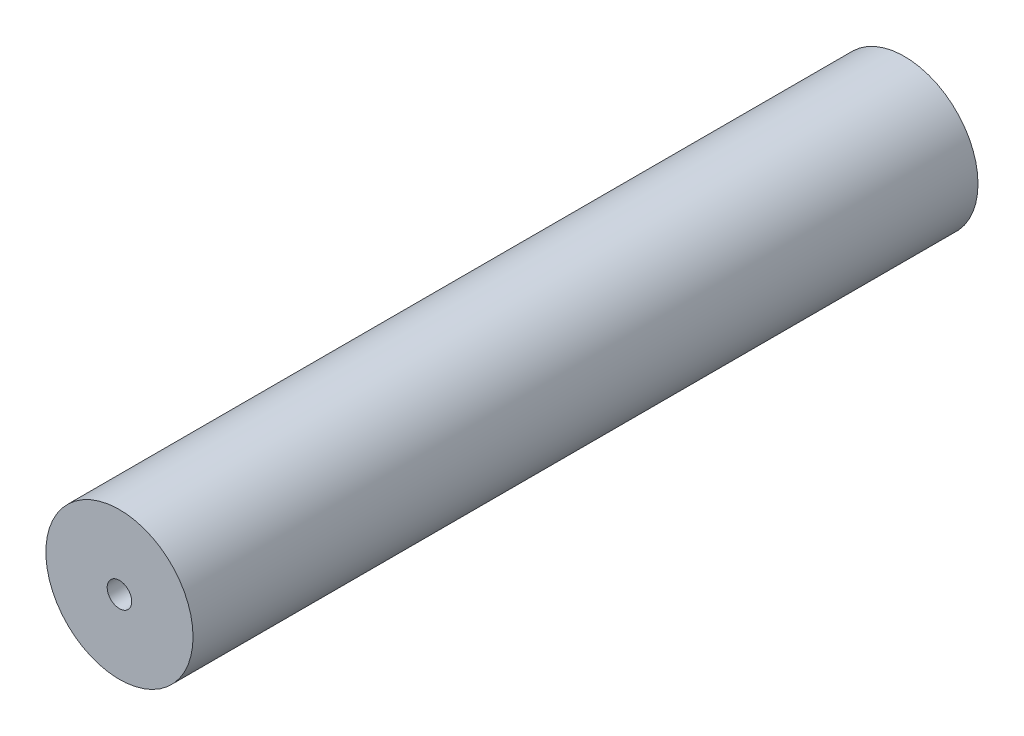
ISO-10303-21;
HEADER;
FILE_DESCRIPTION(('STEP AP214'),'2;1');
FILE_NAME('part.step','',(''),(''),'','','');
FILE_SCHEMA(('AUTOMOTIVE_DESIGN { 1 0 10303 214 1 1 1 1 }'));
ENDSEC;
DATA;
#1=APPLICATION_CONTEXT('core data for automotive mechanical design processes');
#2=APPLICATION_PROTOCOL_DEFINITION('international standard','automotive_design',2000,#1);
#3=PRODUCT_CONTEXT('',#1,'mechanical');
#4=PRODUCT('Part','Part','',(#3));
#5=PRODUCT_RELATED_PRODUCT_CATEGORY('part','',(#4));
#6=PRODUCT_DEFINITION_FORMATION('','',#4);
#7=PRODUCT_DEFINITION_CONTEXT('part definition',#1,'design');
#8=PRODUCT_DEFINITION('design','',#6,#7);
#9=PRODUCT_DEFINITION_SHAPE('','',#8);
#10=(LENGTH_UNIT() NAMED_UNIT(*) SI_UNIT(.MILLI.,.METRE.));
#11=(NAMED_UNIT(*) PLANE_ANGLE_UNIT() SI_UNIT($,.RADIAN.));
#12=(NAMED_UNIT(*) SI_UNIT($,.STERADIAN.) SOLID_ANGLE_UNIT());
#13=UNCERTAINTY_MEASURE_WITH_UNIT(LENGTH_MEASURE(1.E-05),#10,'distance_accuracy_value','');
#14=(GEOMETRIC_REPRESENTATION_CONTEXT(3) GLOBAL_UNCERTAINTY_ASSIGNED_CONTEXT((#13)) GLOBAL_UNIT_ASSIGNED_CONTEXT((#10,
#11,#12)) REPRESENTATION_CONTEXT('',''));
#15=CARTESIAN_POINT('',(0.,0.,0.));
#16=DIRECTION('',(0.,0.,1.));
#17=DIRECTION('',(1.,0.,0.));
#18=AXIS2_PLACEMENT_3D('',#15,#16,#17);
#19=CARTESIAN_POINT('',(0.,0.,80.));
#20=DIRECTION('',(0.,0.,-1.));
#21=DIRECTION('',(-1.,0.,0.));
#22=AXIS2_PLACEMENT_3D('',#19,#20,#21);
#23=CYLINDRICAL_SURFACE('',#22,7.5);
#24=CARTESIAN_POINT('',(0.,0.,80.));
#25=DIRECTION('',(0.,0.,1.));
#26=DIRECTION('',(1.,0.,0.));
#27=AXIS2_PLACEMENT_3D('',#24,#25,#26);
#28=CIRCLE('',#27,7.5);
#29=CARTESIAN_POINT('',(7.5,0.,80.));
#30=VERTEX_POINT('',#29);
#31=EDGE_CURVE('E11',#30,#30,#28,.T.);
#32=ORIENTED_EDGE('',*,*,#31,.F.);
#33=EDGE_LOOP('',(#32));
#34=FACE_BOUND('',#33,.T.);
#35=CARTESIAN_POINT('',(0.,0.,0.));
#36=DIRECTION('',(0.,0.,1.));
#37=DIRECTION('',(1.,0.,0.));
#38=AXIS2_PLACEMENT_3D('',#35,#36,#37);
#39=CIRCLE('',#38,7.5);
#40=CARTESIAN_POINT('',(7.5,0.,0.));
#41=VERTEX_POINT('',#40);
#42=EDGE_CURVE('E39',#41,#41,#39,.T.);
#43=ORIENTED_EDGE('',*,*,#42,.T.);
#44=EDGE_LOOP('',(#43));
#45=FACE_BOUND('',#44,.T.);
#46=ADVANCED_FACE('F36',(#34,#45),#23,.T.);
#47=CARTESIAN_POINT('',(0.,0.,80.));
#48=DIRECTION('',(0.,0.,1.));
#49=DIRECTION('',(1.,0.,0.));
#50=AXIS2_PLACEMENT_3D('',#47,#48,#49);
#51=PLANE('',#50);
#52=CARTESIAN_POINT('',(0.,0.,80.));
#53=DIRECTION('',(0.,0.,1.));
#54=DIRECTION('',(1.,0.,0.));
#55=AXIS2_PLACEMENT_3D('',#52,#53,#54);
#56=CIRCLE('',#55,1.25);
#57=CARTESIAN_POINT('',(1.25,0.,80.));
#58=VERTEX_POINT('',#57);
#59=EDGE_CURVE('E59',#58,#58,#56,.T.);
#60=ORIENTED_EDGE('',*,*,#59,.F.);
#61=EDGE_LOOP('',(#60));
#62=FACE_BOUND('',#61,.T.);
#63=ORIENTED_EDGE('',*,*,#31,.T.);
#64=EDGE_LOOP('',(#63));
#65=FACE_BOUND('',#64,.T.);
#66=ADVANCED_FACE('F78',(#62,#65),#51,.T.);
#67=CARTESIAN_POINT('',(0.,0.,0.));
#68=DIRECTION('',(0.,0.,1.));
#69=DIRECTION('',(1.,0.,0.));
#70=AXIS2_PLACEMENT_3D('',#67,#68,#69);
#71=PLANE('',#70);
#72=CARTESIAN_POINT('',(0.,0.,0.));
#73=DIRECTION('',(0.,0.,-1.));
#74=DIRECTION('',(-1.,0.,0.));
#75=AXIS2_PLACEMENT_3D('',#72,#73,#74);
#76=CIRCLE('',#75,1.24999999999999);
#77=CARTESIAN_POINT('',(-1.24999999999999,0.,0.));
#78=VERTEX_POINT('',#77);
#79=EDGE_CURVE('E60',#78,#78,#76,.T.);
#80=ORIENTED_EDGE('',*,*,#79,.F.);
#81=EDGE_LOOP('',(#80));
#82=FACE_BOUND('',#81,.T.);
#83=ORIENTED_EDGE('',*,*,#42,.F.);
#84=EDGE_LOOP('',(#83));
#85=FACE_BOUND('',#84,.T.);
#86=ADVANCED_FACE('F75',(#82,#85),#71,.F.);
#87=CARTESIAN_POINT('',(0.,0.,70.));
#88=DIRECTION('',(0.,0.,1.));
#89=DIRECTION('',(1.,0.,0.));
#90=AXIS2_PLACEMENT_3D('',#87,#88,#89);
#91=CONICAL_SURFACE('',#90,1.25,1.02974425867665);
#92=CARTESIAN_POINT('',(0.,0.,69.2489242262155));
#93=VERTEX_POINT('',#92);
#94=VERTEX_LOOP('',#93);
#95=FACE_BOUND('',#94,.T.);
#96=CARTESIAN_POINT('',(0.,0.,70.));
#97=DIRECTION('',(0.,0.,1.));
#98=DIRECTION('',(1.,0.,0.));
#99=AXIS2_PLACEMENT_3D('',#96,#97,#98);
#100=CIRCLE('',#99,1.25);
#101=CARTESIAN_POINT('',(1.25,0.,70.));
#102=VERTEX_POINT('',#101);
#103=EDGE_CURVE('E63',#102,#102,#100,.T.);
#104=ORIENTED_EDGE('',*,*,#103,.T.);
#105=EDGE_LOOP('',(#104));
#106=FACE_BOUND('',#105,.T.);
#107=ADVANCED_FACE('F77',(#95,#106),#91,.F.);
#108=CARTESIAN_POINT('',(0.,0.,80.));
#109=DIRECTION('',(0.,0.,1.));
#110=DIRECTION('',(1.,0.,0.));
#111=AXIS2_PLACEMENT_3D('',#108,#109,#110);
#112=CYLINDRICAL_SURFACE('',#111,1.25);
#113=ORIENTED_EDGE('',*,*,#103,.F.);
#114=EDGE_LOOP('',(#113));
#115=FACE_BOUND('',#114,.T.);
#116=ORIENTED_EDGE('',*,*,#59,.T.);
#117=EDGE_LOOP('',(#116));
#118=FACE_BOUND('',#117,.T.);
#119=ADVANCED_FACE('F53',(#115,#118),#112,.F.);
#120=CARTESIAN_POINT('',(0.,0.,9.99999999999999));
#121=DIRECTION('',(0.,0.,-1.));
#122=DIRECTION('',(-1.,0.,0.));
#123=AXIS2_PLACEMENT_3D('',#120,#121,#122);
#124=CONICAL_SURFACE('',#123,1.24999999999999,1.02974425867665);
#125=CARTESIAN_POINT('',(0.,0.,10.7510757737845));
#126=VERTEX_POINT('',#125);
#127=VERTEX_LOOP('',#126);
#128=FACE_BOUND('',#127,.T.);
#129=CARTESIAN_POINT('',(0.,0.,9.99999999999999));
#130=DIRECTION('',(0.,0.,-1.));
#131=DIRECTION('',(-1.,0.,0.));
#132=AXIS2_PLACEMENT_3D('',#129,#130,#131);
#133=CIRCLE('',#132,1.24999999999999);
#134=CARTESIAN_POINT('',(-1.24999999999999,0.,9.99999999999999));
#135=VERTEX_POINT('',#134);
#136=EDGE_CURVE('E57',#135,#135,#133,.T.);
#137=ORIENTED_EDGE('',*,*,#136,.T.);
#138=EDGE_LOOP('',(#137));
#139=FACE_BOUND('',#138,.T.);
#140=ADVANCED_FACE('F49',(#128,#139),#124,.F.);
#141=CARTESIAN_POINT('',(0.,0.,0.));
#142=DIRECTION('',(0.,0.,-1.));
#143=DIRECTION('',(-1.,0.,0.));
#144=AXIS2_PLACEMENT_3D('',#141,#142,#143);
#145=CYLINDRICAL_SURFACE('',#144,1.24999999999999);
#146=ORIENTED_EDGE('',*,*,#136,.F.);
#147=EDGE_LOOP('',(#146));
#148=FACE_BOUND('',#147,.T.);
#149=ORIENTED_EDGE('',*,*,#79,.T.);
#150=EDGE_LOOP('',(#149));
#151=FACE_BOUND('',#150,.T.);
#152=ADVANCED_FACE('F52',(#148,#151),#145,.F.);
#153=CLOSED_SHELL('',(#46,#66,#86,#107,#119,#140,#152));
#154=MANIFOLD_SOLID_BREP('B2',#153);
#155=ADVANCED_BREP_SHAPE_REPRESENTATION('',(#18,#154),#14);
#156=SHAPE_DEFINITION_REPRESENTATION(#9,#155);
ENDSEC;
END-ISO-10303-21;
